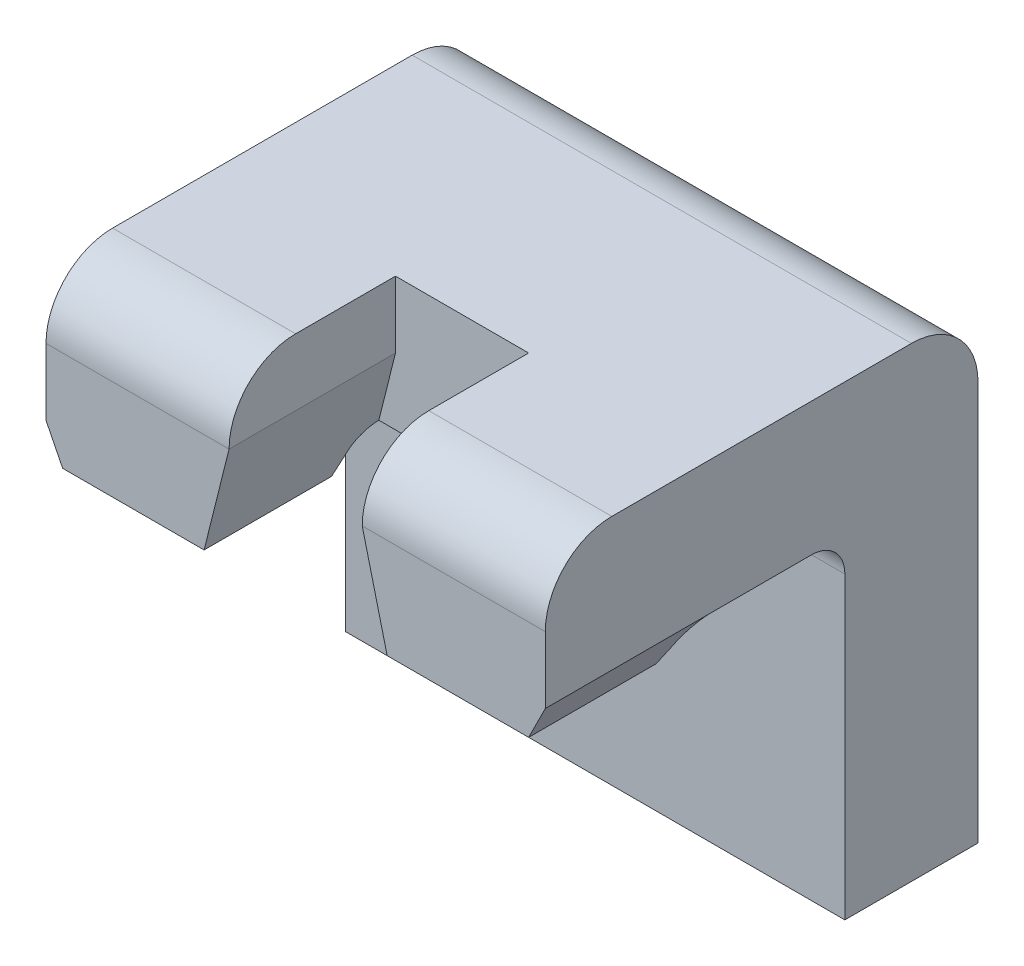
ISO-10303-21;
HEADER;
FILE_DESCRIPTION(('STEP AP214'),'2;1');
FILE_NAME('part.step','',(''),(''),'','','');
FILE_SCHEMA(('AUTOMOTIVE_DESIGN { 1 0 10303 214 1 1 1 1 }'));
ENDSEC;
DATA;
#1=APPLICATION_CONTEXT('core data for automotive mechanical design processes');
#2=APPLICATION_PROTOCOL_DEFINITION('international standard','automotive_design',2000,#1);
#3=PRODUCT_CONTEXT('',#1,'mechanical');
#4=PRODUCT('Part','Part','',(#3));
#5=PRODUCT_RELATED_PRODUCT_CATEGORY('part','',(#4));
#6=PRODUCT_DEFINITION_FORMATION('','',#4);
#7=PRODUCT_DEFINITION_CONTEXT('part definition',#1,'design');
#8=PRODUCT_DEFINITION('design','',#6,#7);
#9=PRODUCT_DEFINITION_SHAPE('','',#8);
#10=(LENGTH_UNIT() NAMED_UNIT(*) SI_UNIT(.MILLI.,.METRE.));
#11=(NAMED_UNIT(*) PLANE_ANGLE_UNIT() SI_UNIT($,.RADIAN.));
#12=(NAMED_UNIT(*) SI_UNIT($,.STERADIAN.) SOLID_ANGLE_UNIT());
#13=UNCERTAINTY_MEASURE_WITH_UNIT(LENGTH_MEASURE(1.E-05),#10,'distance_accuracy_value','');
#14=(GEOMETRIC_REPRESENTATION_CONTEXT(3) GLOBAL_UNCERTAINTY_ASSIGNED_CONTEXT((#13)) GLOBAL_UNIT_ASSIGNED_CONTEXT((#10,
#11,#12)) REPRESENTATION_CONTEXT('',''));
#15=CARTESIAN_POINT('',(0.,0.,0.));
#16=DIRECTION('',(0.,0.,1.));
#17=DIRECTION('',(1.,0.,0.));
#18=AXIS2_PLACEMENT_3D('',#15,#16,#17);
#19=CARTESIAN_POINT('',(-0.415796148106,0.4,0.49));
#20=DIRECTION('',(0.,0.531864359009179,0.846829559956285));
#21=DIRECTION('',(0.,-0.846829559956285,0.531864359009179));
#22=AXIS2_PLACEMENT_3D('',#19,#20,#21);
#23=PLANE('',#22);
#24=DIRECTION('',(-1.,0.,0.));
#25=VECTOR('',#24,1.);
#26=CARTESIAN_POINT('',(-0.875,0.45,0.45859672925));
#27=LINE('',#26,#25);
#28=CARTESIAN_POINT('',(0.35,0.45,0.45859672925));
#29=VERTEX_POINT('',#28);
#30=CARTESIAN_POINT('',(0.137500000000008,0.450000000000002,0.45859672925));
#31=VERTEX_POINT('',#30);
#32=EDGE_CURVE('E301',#29,#31,#27,.T.);
#33=ORIENTED_EDGE('',*,*,#32,.T.);
#34=DIRECTION('',(-0.207116775159689,0.82846710063961,-0.520331533356617));
#35=VECTOR('',#34,1.);
#36=CARTESIAN_POINT('',(0.137500000000012,0.450000000000003,0.45859672925));
#37=LINE('',#36,#35);
#38=CARTESIAN_POINT('',(0.132202135712893,0.471191457148502,0.445287107921827));
#39=VERTEX_POINT('',#38);
#40=EDGE_CURVE('E274',#31,#39,#37,.T.);
#41=ORIENTED_EDGE('',*,*,#40,.T.);
#42=DIRECTION('',(1.,0.,0.));
#43=VECTOR('',#42,1.);
#44=CARTESIAN_POINT('',(-0.375,0.47119145714682,0.445287107922614));
#45=LINE('',#44,#43);
#46=CARTESIAN_POINT('',(0.360595728573993,0.471191457147986,0.445287107922069));
#47=VERTEX_POINT('',#46);
#48=EDGE_CURVE('E178',#39,#47,#45,.T.);
#49=ORIENTED_EDGE('',*,*,#48,.T.);
#50=DIRECTION('',(-0.389903858619995,-0.779807717239989,0.489770257535302));
#51=VECTOR('',#50,1.);
#52=CARTESIAN_POINT('',(0.3605957285734,0.4711914571468,0.445287107923));
#53=LINE('',#52,#51);
#54=EDGE_CURVE('E291',#47,#29,#53,.T.);
#55=ORIENTED_EDGE('',*,*,#54,.T.);
#56=EDGE_LOOP('',(#33,#41,#49,#55));
#57=FACE_BOUND('',#56,.T.);
#58=ADVANCED_FACE('F17',(#57),#23,.F.);
#59=CARTESIAN_POINT('',(-0.875,0.45,0.));
#60=DIRECTION('',(0.,1.,0.));
#61=DIRECTION('',(-1.,0.,0.));
#62=AXIS2_PLACEMENT_3D('',#59,#60,#61);
#63=PLANE('',#62);
#64=DIRECTION('',(0.,0.,1.));
#65=VECTOR('',#64,1.);
#66=CARTESIAN_POINT('',(0.35,0.45,0.4));
#67=LINE('',#66,#65);
#68=CARTESIAN_POINT('',(0.35,0.45,0.65));
#69=VERTEX_POINT('',#68);
#70=EDGE_CURVE('E288',#29,#69,#67,.T.);
#71=ORIENTED_EDGE('',*,*,#70,.T.);
#72=DIRECTION('',(1.,0.,0.));
#73=VECTOR('',#72,1.);
#74=CARTESIAN_POINT('',(-0.375,0.45,0.65));
#75=LINE('',#74,#73);
#76=CARTESIAN_POINT('',(0.137500000000006,0.450000000000001,0.65));
#77=VERTEX_POINT('',#76);
#78=EDGE_CURVE('E290',#77,#69,#75,.T.);
#79=ORIENTED_EDGE('',*,*,#78,.F.);
#80=DIRECTION('',(0.,0.,1.));
#81=VECTOR('',#80,1.);
#82=CARTESIAN_POINT('',(0.137500000000012,0.450000000000003,0.4));
#83=LINE('',#82,#81);
#84=EDGE_CURVE('E279',#77,#31,#83,.F.);
#85=ORIENTED_EDGE('',*,*,#84,.T.);
#86=ORIENTED_EDGE('',*,*,#32,.F.);
#87=EDGE_LOOP('',(#71,#79,#85,#86));
#88=FACE_BOUND('',#87,.T.);
#89=ADVANCED_FACE('F391',(#88),#63,.F.);
#90=CARTESIAN_POINT('',(0.15,0.4,0.4));
#91=DIRECTION('',(0.970142500145391,0.242535625036098,0.));
#92=DIRECTION('',(-0.242535625036098,0.970142500145391,0.));
#93=AXIS2_PLACEMENT_3D('',#90,#91,#92);
#94=PLANE('',#93);
#95=ORIENTED_EDGE('',*,*,#84,.F.);
#96=DIRECTION('',(0.242535625036333,-0.970142500145332,0.));
#97=VECTOR('',#96,1.);
#98=CARTESIAN_POINT('',(0.1,0.6,0.65));
#99=LINE('',#98,#97);
#100=CARTESIAN_POINT('',(0.1,0.6,0.65));
#101=VERTEX_POINT('',#100);
#102=EDGE_CURVE('E282',#101,#77,#99,.T.);
#103=ORIENTED_EDGE('',*,*,#102,.F.);
#104=DIRECTION('',(0.,0.,1.));
#105=VECTOR('',#104,1.);
#106=CARTESIAN_POINT('',(0.1,0.6,0.4));
#107=LINE('',#106,#105);
#108=CARTESIAN_POINT('',(0.1,0.6,0.4));
#109=VERTEX_POINT('',#108);
#110=EDGE_CURVE('E164',#101,#109,#107,.F.);
#111=ORIENTED_EDGE('',*,*,#110,.T.);
#112=DIRECTION('',(0.242535625036333,-0.970142500145332,0.));
#113=VECTOR('',#112,1.);
#114=CARTESIAN_POINT('',(0.1,0.6,0.4));
#115=LINE('',#114,#113);
#116=CARTESIAN_POINT('',(0.125000000000013,0.5,0.4));
#117=VERTEX_POINT('',#116);
#118=EDGE_CURVE('E157',#109,#117,#115,.T.);
#119=ORIENTED_EDGE('',*,*,#118,.T.);
#120=CARTESIAN_POINT('',(0.137500000000013,0.45,0.4));
#121=DIRECTION('',(0.970142500145391,0.242535625036098,0.));
#122=DIRECTION('',(0.242535625036098,-0.970142500145391,0.));
#123=AXIS2_PLACEMENT_3D('',#120,#121,#122);
#124=ELLIPSE('',#123,0.0515388203202176,0.05);
#125=EDGE_CURVE('E20',#117,#39,#124,.T.);
#126=ORIENTED_EDGE('',*,*,#125,.T.);
#127=ORIENTED_EDGE('',*,*,#40,.F.);
#128=EDGE_LOOP('',(#95,#103,#111,#119,#126,#127));
#129=FACE_BOUND('',#128,.T.);
#130=ADVANCED_FACE('F160',(#129),#94,.F.);
#131=CARTESIAN_POINT('',(-0.415796148106,0.4,0.49));
#132=DIRECTION('',(0.,0.531864359009179,0.846829559956285));
#133=DIRECTION('',(0.,-0.846829559956285,0.531864359009179));
#134=AXIS2_PLACEMENT_3D('',#131,#132,#133);
#135=PLANE('',#134);
#136=DIRECTION('',(-1.,0.,0.));
#137=VECTOR('',#136,1.);
#138=CARTESIAN_POINT('',(-0.875,0.45,0.45859672925));
#139=LINE('',#138,#137);
#140=CARTESIAN_POINT('',(-0.137500000000008,0.450000000000002,0.45859672925));
#141=VERTEX_POINT('',#140);
#142=CARTESIAN_POINT('',(-0.35,0.45,0.45859672925));
#143=VERTEX_POINT('',#142);
#144=EDGE_CURVE('E267',#141,#143,#139,.T.);
#145=ORIENTED_EDGE('',*,*,#144,.T.);
#146=DIRECTION('',(-0.389903858619995,0.779807717239989,-0.489770257535302));
#147=VECTOR('',#146,1.);
#148=CARTESIAN_POINT('',(-0.35,0.45,0.45859672925));
#149=LINE('',#148,#147);
#150=CARTESIAN_POINT('',(-0.360595728573993,0.471191457147986,0.445287107922069));
#151=VERTEX_POINT('',#150);
#152=EDGE_CURVE('E257',#143,#151,#149,.T.);
#153=ORIENTED_EDGE('',*,*,#152,.T.);
#154=DIRECTION('',(1.,0.,0.));
#155=VECTOR('',#154,1.);
#156=CARTESIAN_POINT('',(-0.375,0.47119145714682,0.445287107922614));
#157=LINE('',#156,#155);
#158=CARTESIAN_POINT('',(-0.132202135712893,0.471191457148502,0.445287107921827));
#159=VERTEX_POINT('',#158);
#160=EDGE_CURVE('E209',#151,#159,#157,.T.);
#161=ORIENTED_EDGE('',*,*,#160,.T.);
#162=DIRECTION('',(-0.207116775159689,-0.82846710063961,0.520331533356617));
#163=VECTOR('',#162,1.);
#164=CARTESIAN_POINT('',(-0.132202135713253,0.471191457147063,0.445287107923));
#165=LINE('',#164,#163);
#166=EDGE_CURVE('E265',#159,#141,#165,.T.);
#167=ORIENTED_EDGE('',*,*,#166,.T.);
#168=EDGE_LOOP('',(#145,#153,#161,#167));
#169=FACE_BOUND('',#168,.T.);
#170=ADVANCED_FACE('F425',(#169),#135,.F.);
#171=CARTESIAN_POINT('',(-0.875,0.45,0.));
#172=DIRECTION('',(0.,1.,0.));
#173=DIRECTION('',(-1.,0.,0.));
#174=AXIS2_PLACEMENT_3D('',#171,#172,#173);
#175=PLANE('',#174);
#176=DIRECTION('',(0.,0.,1.));
#177=VECTOR('',#176,1.);
#178=CARTESIAN_POINT('',(-0.137500000000012,0.450000000000003,0.4));
#179=LINE('',#178,#177);
#180=CARTESIAN_POINT('',(-0.137500000000004,0.450000000000001,0.65));
#181=VERTEX_POINT('',#180);
#182=EDGE_CURVE('E241',#141,#181,#179,.T.);
#183=ORIENTED_EDGE('',*,*,#182,.T.);
#184=DIRECTION('',(1.,0.,0.));
#185=VECTOR('',#184,1.);
#186=CARTESIAN_POINT('',(-0.375,0.45,0.65));
#187=LINE('',#186,#185);
#188=CARTESIAN_POINT('',(-0.35,0.45,0.65));
#189=VERTEX_POINT('',#188);
#190=EDGE_CURVE('E251',#189,#181,#187,.T.);
#191=ORIENTED_EDGE('',*,*,#190,.F.);
#192=DIRECTION('',(0.,0.,1.));
#193=VECTOR('',#192,1.);
#194=CARTESIAN_POINT('',(-0.35,0.45,0.4));
#195=LINE('',#194,#193);
#196=EDGE_CURVE('E254',#189,#143,#195,.F.);
#197=ORIENTED_EDGE('',*,*,#196,.T.);
#198=ORIENTED_EDGE('',*,*,#144,.F.);
#199=EDGE_LOOP('',(#183,#191,#197,#198));
#200=FACE_BOUND('',#199,.T.);
#201=ADVANCED_FACE('F419',(#200),#175,.F.);
#202=CARTESIAN_POINT('',(-0.15,0.4,0.4));
#203=DIRECTION('',(-0.970142500145391,0.242535625036098,0.));
#204=DIRECTION('',(-0.242535625036098,-0.970142500145391,0.));
#205=AXIS2_PLACEMENT_3D('',#202,#203,#204);
#206=PLANE('',#205);
#207=ORIENTED_EDGE('',*,*,#182,.F.);
#208=ORIENTED_EDGE('',*,*,#166,.F.);
#209=CARTESIAN_POINT('',(-0.137500000000013,0.45,0.4));
#210=DIRECTION('',(-0.970142500145391,0.242535625036098,0.));
#211=DIRECTION('',(0.242535625036098,0.970142500145391,0.));
#212=AXIS2_PLACEMENT_3D('',#209,#210,#211);
#213=ELLIPSE('',#212,0.0515388203202176,0.05);
#214=CARTESIAN_POINT('',(-0.125000000000013,0.5,0.4));
#215=VERTEX_POINT('',#214);
#216=EDGE_CURVE('E210',#159,#215,#213,.T.);
#217=ORIENTED_EDGE('',*,*,#216,.T.);
#218=DIRECTION('',(0.242535625036333,0.970142500145332,0.));
#219=VECTOR('',#218,1.);
#220=CARTESIAN_POINT('',(-0.125,0.5,0.4));
#221=LINE('',#220,#219);
#222=CARTESIAN_POINT('',(-0.1,0.6,0.4));
#223=VERTEX_POINT('',#222);
#224=EDGE_CURVE('E169',#215,#223,#221,.T.);
#225=ORIENTED_EDGE('',*,*,#224,.T.);
#226=DIRECTION('',(0.,0.,1.));
#227=VECTOR('',#226,1.);
#228=CARTESIAN_POINT('',(-0.1,0.6,0.4));
#229=LINE('',#228,#227);
#230=CARTESIAN_POINT('',(-0.1,0.6,0.65));
#231=VERTEX_POINT('',#230);
#232=EDGE_CURVE('E218',#223,#231,#229,.T.);
#233=ORIENTED_EDGE('',*,*,#232,.T.);
#234=DIRECTION('',(0.242535625036333,0.970142500145332,0.));
#235=VECTOR('',#234,1.);
#236=CARTESIAN_POINT('',(-0.1375,0.45,0.65));
#237=LINE('',#236,#235);
#238=EDGE_CURVE('E247',#181,#231,#237,.T.);
#239=ORIENTED_EDGE('',*,*,#238,.F.);
#240=EDGE_LOOP('',(#207,#208,#217,#225,#233,#239));
#241=FACE_BOUND('',#240,.T.);
#242=ADVANCED_FACE('F340',(#241),#206,.F.);
#243=CARTESIAN_POINT('',(0.1,0.4,0.4));
#244=DIRECTION('',(1.,0.,0.));
#245=DIRECTION('',(0.,1.,0.));
#246=AXIS2_PLACEMENT_3D('',#243,#244,#245);
#247=PLANE('',#246);
#248=ORIENTED_EDGE('',*,*,#110,.F.);
#249=CARTESIAN_POINT('',(0.1,0.6,0.55));
#250=DIRECTION('',(1.,0.,0.));
#251=DIRECTION('',(0.,0.,-1.));
#252=AXIS2_PLACEMENT_3D('',#249,#250,#251);
#253=CIRCLE('',#252,0.1);
#254=CARTESIAN_POINT('',(0.1,0.7,0.55));
#255=VERTEX_POINT('',#254);
#256=EDGE_CURVE('E334',#255,#101,#253,.T.);
#257=ORIENTED_EDGE('',*,*,#256,.F.);
#258=DIRECTION('',(0.,0.,1.));
#259=VECTOR('',#258,1.);
#260=CARTESIAN_POINT('',(0.1,0.7,0.55));
#261=LINE('',#260,#259);
#262=CARTESIAN_POINT('',(0.1,0.7,0.4));
#263=VERTEX_POINT('',#262);
#264=EDGE_CURVE('E208',#263,#255,#261,.T.);
#265=ORIENTED_EDGE('',*,*,#264,.F.);
#266=DIRECTION('',(0.,1.,0.));
#267=VECTOR('',#266,1.);
#268=CARTESIAN_POINT('',(0.1,0.7,0.4));
#269=LINE('',#268,#267);
#270=EDGE_CURVE('E170',#263,#109,#269,.F.);
#271=ORIENTED_EDGE('',*,*,#270,.T.);
#272=EDGE_LOOP('',(#248,#257,#265,#271));
#273=FACE_BOUND('',#272,.T.);
#274=ADVANCED_FACE('F404',(#273),#247,.F.);
#275=CARTESIAN_POINT('',(-0.1,0.4,0.4));
#276=DIRECTION('',(-1.,0.,0.));
#277=DIRECTION('',(0.,-1.,0.));
#278=AXIS2_PLACEMENT_3D('',#275,#276,#277);
#279=PLANE('',#278);
#280=ORIENTED_EDGE('',*,*,#232,.F.);
#281=DIRECTION('',(0.,1.,0.));
#282=VECTOR('',#281,1.);
#283=CARTESIAN_POINT('',(-0.1,0.7,0.4));
#284=LINE('',#283,#282);
#285=CARTESIAN_POINT('',(-0.1,0.7,0.4));
#286=VERTEX_POINT('',#285);
#287=EDGE_CURVE('E179',#223,#286,#284,.T.);
#288=ORIENTED_EDGE('',*,*,#287,.T.);
#289=DIRECTION('',(0.,0.,1.));
#290=VECTOR('',#289,1.);
#291=CARTESIAN_POINT('',(-0.1,0.7,0.55));
#292=LINE('',#291,#290);
#293=CARTESIAN_POINT('',(-0.1,0.7,0.55));
#294=VERTEX_POINT('',#293);
#295=EDGE_CURVE('E222',#294,#286,#292,.F.);
#296=ORIENTED_EDGE('',*,*,#295,.F.);
#297=CARTESIAN_POINT('',(-0.1,0.6,0.55));
#298=DIRECTION('',(1.,0.,0.));
#299=DIRECTION('',(0.,0.,-1.));
#300=AXIS2_PLACEMENT_3D('',#297,#298,#299);
#301=CIRCLE('',#300,0.1);
#302=EDGE_CURVE('E329',#231,#294,#301,.F.);
#303=ORIENTED_EDGE('',*,*,#302,.F.);
#304=EDGE_LOOP('',(#280,#288,#296,#303));
#305=FACE_BOUND('',#304,.T.);
#306=ADVANCED_FACE('F412',(#305),#279,.F.);
#307=CARTESIAN_POINT('',(-0.375,0.45,0.4));
#308=DIRECTION('',(1.,0.,0.));
#309=DIRECTION('',(0.,0.,-1.));
#310=AXIS2_PLACEMENT_3D('',#307,#308,#309);
#311=CYLINDRICAL_SURFACE('',#310,0.05);
#312=DIRECTION('',(1.,0.,0.));
#313=VECTOR('',#312,1.);
#314=CARTESIAN_POINT('',(-0.375,0.5,0.4));
#315=LINE('',#314,#313);
#316=CARTESIAN_POINT('',(0.375,0.5,0.4));
#317=VERTEX_POINT('',#316);
#318=EDGE_CURVE('E176',#317,#117,#315,.F.);
#319=ORIENTED_EDGE('',*,*,#318,.F.);
#320=CARTESIAN_POINT('',(0.35,0.45,0.4));
#321=DIRECTION('',(-0.894427190999916,0.447213595499958,0.));
#322=DIRECTION('',(0.447213595499958,0.894427190999916,0.));
#323=AXIS2_PLACEMENT_3D('',#320,#321,#322);
#324=ELLIPSE('',#323,0.0559016994374947,0.05);
#325=EDGE_CURVE('E332',#317,#47,#324,.F.);
#326=ORIENTED_EDGE('',*,*,#325,.T.);
#327=ORIENTED_EDGE('',*,*,#48,.F.);
#328=ORIENTED_EDGE('',*,*,#125,.F.);
#329=EDGE_LOOP('',(#319,#326,#327,#328));
#330=FACE_BOUND('',#329,.T.);
#331=ADVANCED_FACE('F173',(#330),#311,.F.);
#332=CARTESIAN_POINT('',(0.1,0.7,0.4));
#333=DIRECTION('',(0.,0.,-1.));
#334=DIRECTION('',(-1.,0.,0.));
#335=AXIS2_PLACEMENT_3D('',#332,#333,#334);
#336=PLANE('',#335);
#337=DIRECTION('',(1.,0.,0.));
#338=VECTOR('',#337,1.);
#339=CARTESIAN_POINT('',(-0.375,0.5,0.4));
#340=LINE('',#339,#338);
#341=EDGE_CURVE('E182',#117,#215,#340,.F.);
#342=ORIENTED_EDGE('',*,*,#341,.F.);
#343=ORIENTED_EDGE('',*,*,#118,.F.);
#344=ORIENTED_EDGE('',*,*,#270,.F.);
#345=DIRECTION('',(1.,0.,0.));
#346=VECTOR('',#345,1.);
#347=CARTESIAN_POINT('',(-0.375,0.7,0.4));
#348=LINE('',#347,#346);
#349=EDGE_CURVE('E225',#286,#263,#348,.T.);
#350=ORIENTED_EDGE('',*,*,#349,.F.);
#351=ORIENTED_EDGE('',*,*,#287,.F.);
#352=ORIENTED_EDGE('',*,*,#224,.F.);
#353=EDGE_LOOP('',(#342,#343,#344,#350,#351,#352));
#354=FACE_BOUND('',#353,.T.);
#355=ADVANCED_FACE('F183',(#354),#336,.F.);
#356=CARTESIAN_POINT('',(-0.375,0.45,0.4));
#357=DIRECTION('',(1.,0.,0.));
#358=DIRECTION('',(0.,0.,-1.));
#359=AXIS2_PLACEMENT_3D('',#356,#357,#358);
#360=CYLINDRICAL_SURFACE('',#359,0.05);
#361=DIRECTION('',(1.,0.,0.));
#362=VECTOR('',#361,1.);
#363=CARTESIAN_POINT('',(-0.375,0.5,0.4));
#364=LINE('',#363,#362);
#365=CARTESIAN_POINT('',(-0.375,0.5,0.4));
#366=VERTEX_POINT('',#365);
#367=EDGE_CURVE('E189',#215,#366,#364,.F.);
#368=ORIENTED_EDGE('',*,*,#367,.F.);
#369=ORIENTED_EDGE('',*,*,#216,.F.);
#370=ORIENTED_EDGE('',*,*,#160,.F.);
#371=CARTESIAN_POINT('',(-0.35,0.45,0.4));
#372=DIRECTION('',(0.894427190999916,0.447213595499958,0.));
#373=DIRECTION('',(0.447213595499958,-0.894427190999916,0.));
#374=AXIS2_PLACEMENT_3D('',#371,#372,#373);
#375=ELLIPSE('',#374,0.0559016994374947,0.05);
#376=EDGE_CURVE('E258',#151,#366,#375,.F.);
#377=ORIENTED_EDGE('',*,*,#376,.T.);
#378=EDGE_LOOP('',(#368,#369,#370,#377));
#379=FACE_BOUND('',#378,.T.);
#380=ADVANCED_FACE('F342',(#379),#360,.F.);
#381=CARTESIAN_POINT('',(-0.375,0.6,0.55));
#382=DIRECTION('',(1.,0.,0.));
#383=DIRECTION('',(0.,0.,-1.));
#384=AXIS2_PLACEMENT_3D('',#381,#382,#383);
#385=CYLINDRICAL_SURFACE('',#384,0.1);
#386=CARTESIAN_POINT('',(0.375,0.6,0.55));
#387=DIRECTION('',(1.,0.,0.));
#388=DIRECTION('',(0.,0.,-1.));
#389=AXIS2_PLACEMENT_3D('',#386,#387,#388);
#390=CIRCLE('',#389,0.1);
#391=CARTESIAN_POINT('',(0.375,0.6,0.65));
#392=VERTEX_POINT('',#391);
#393=CARTESIAN_POINT('',(0.375,0.7,0.55));
#394=VERTEX_POINT('',#393);
#395=EDGE_CURVE('E326',#392,#394,#390,.F.);
#396=ORIENTED_EDGE('',*,*,#395,.T.);
#397=DIRECTION('',(1.,0.,0.));
#398=VECTOR('',#397,1.);
#399=CARTESIAN_POINT('',(-0.375,0.7,0.55));
#400=LINE('',#399,#398);
#401=EDGE_CURVE('E204',#255,#394,#400,.T.);
#402=ORIENTED_EDGE('',*,*,#401,.F.);
#403=ORIENTED_EDGE('',*,*,#256,.T.);
#404=DIRECTION('',(1.,0.,0.));
#405=VECTOR('',#404,1.);
#406=CARTESIAN_POINT('',(-0.375,0.6,0.65));
#407=LINE('',#406,#405);
#408=EDGE_CURVE('E285',#392,#101,#407,.F.);
#409=ORIENTED_EDGE('',*,*,#408,.F.);
#410=EDGE_LOOP('',(#396,#402,#403,#409));
#411=FACE_BOUND('',#410,.T.);
#412=ADVANCED_FACE('F401',(#411),#385,.T.);
#413=CARTESIAN_POINT('',(0.375,0.5,0.4));
#414=DIRECTION('',(-0.894427190999916,0.447213595499958,0.));
#415=DIRECTION('',(-0.447213595499958,-0.894427190999916,0.));
#416=AXIS2_PLACEMENT_3D('',#413,#414,#415);
#417=PLANE('',#416);
#418=ORIENTED_EDGE('',*,*,#70,.F.);
#419=ORIENTED_EDGE('',*,*,#54,.F.);
#420=ORIENTED_EDGE('',*,*,#325,.F.);
#421=DIRECTION('',(0.,0.,1.));
#422=VECTOR('',#421,1.);
#423=CARTESIAN_POINT('',(0.375,0.5,0.25));
#424=LINE('',#423,#422);
#425=CARTESIAN_POINT('',(0.375,0.5,0.65));
#426=VERTEX_POINT('',#425);
#427=EDGE_CURVE('E381',#317,#426,#424,.T.);
#428=ORIENTED_EDGE('',*,*,#427,.T.);
#429=DIRECTION('',(0.447213595499959,0.894427190999915,0.));
#430=VECTOR('',#429,1.);
#431=CARTESIAN_POINT('',(0.35,0.45,0.65));
#432=LINE('',#431,#430);
#433=EDGE_CURVE('E296',#69,#426,#432,.T.);
#434=ORIENTED_EDGE('',*,*,#433,.F.);
#435=EDGE_LOOP('',(#418,#419,#420,#428,#434));
#436=FACE_BOUND('',#435,.T.);
#437=ADVANCED_FACE('F393',(#436),#417,.F.);
#438=CARTESIAN_POINT('',(-0.375,0.4,0.65));
#439=DIRECTION('',(0.,0.,1.));
#440=DIRECTION('',(1.,0.,0.));
#441=AXIS2_PLACEMENT_3D('',#438,#439,#440);
#442=PLANE('',#441);
#443=ORIENTED_EDGE('',*,*,#408,.T.);
#444=ORIENTED_EDGE('',*,*,#102,.T.);
#445=ORIENTED_EDGE('',*,*,#78,.T.);
#446=ORIENTED_EDGE('',*,*,#433,.T.);
#447=DIRECTION('',(0.,1.,0.));
#448=VECTOR('',#447,1.);
#449=CARTESIAN_POINT('',(0.375,0.45,0.65));
#450=LINE('',#449,#448);
#451=EDGE_CURVE('E383',#426,#392,#450,.T.);
#452=ORIENTED_EDGE('',*,*,#451,.T.);
#453=EDGE_LOOP('',(#443,#444,#445,#446,#452));
#454=FACE_BOUND('',#453,.T.);
#455=ADVANCED_FACE('F398',(#454),#442,.T.);
#456=CARTESIAN_POINT('',(-0.375,0.5,0.4));
#457=DIRECTION('',(0.894427190999916,0.447213595499958,0.));
#458=DIRECTION('',(-0.447213595499958,0.894427190999916,0.));
#459=AXIS2_PLACEMENT_3D('',#456,#457,#458);
#460=PLANE('',#459);
#461=ORIENTED_EDGE('',*,*,#196,.F.);
#462=DIRECTION('',(0.447213595499958,-0.894427190999916,0.));
#463=VECTOR('',#462,1.);
#464=CARTESIAN_POINT('',(-0.375,0.5,0.65));
#465=LINE('',#464,#463);
#466=CARTESIAN_POINT('',(-0.375,0.5,0.65));
#467=VERTEX_POINT('',#466);
#468=EDGE_CURVE('E250',#467,#189,#465,.T.);
#469=ORIENTED_EDGE('',*,*,#468,.F.);
#470=DIRECTION('',(0.,0.,1.));
#471=VECTOR('',#470,1.);
#472=CARTESIAN_POINT('',(-0.375,0.5,0.25));
#473=LINE('',#472,#471);
#474=EDGE_CURVE('E353',#366,#467,#473,.T.);
#475=ORIENTED_EDGE('',*,*,#474,.F.);
#476=ORIENTED_EDGE('',*,*,#376,.F.);
#477=ORIENTED_EDGE('',*,*,#152,.F.);
#478=EDGE_LOOP('',(#461,#469,#475,#476,#477));
#479=FACE_BOUND('',#478,.T.);
#480=ADVANCED_FACE('F423',(#479),#460,.F.);
#481=CARTESIAN_POINT('',(-0.375,0.4,0.65));
#482=DIRECTION('',(0.,0.,1.));
#483=DIRECTION('',(1.,0.,0.));
#484=AXIS2_PLACEMENT_3D('',#481,#482,#483);
#485=PLANE('',#484);
#486=DIRECTION('',(0.,1.,0.));
#487=VECTOR('',#486,1.);
#488=CARTESIAN_POINT('',(-0.375,0.45,0.65));
#489=LINE('',#488,#487);
#490=CARTESIAN_POINT('',(-0.375,0.6,0.65));
#491=VERTEX_POINT('',#490);
#492=EDGE_CURVE('E319',#467,#491,#489,.T.);
#493=ORIENTED_EDGE('',*,*,#492,.F.);
#494=ORIENTED_EDGE('',*,*,#468,.T.);
#495=ORIENTED_EDGE('',*,*,#190,.T.);
#496=ORIENTED_EDGE('',*,*,#238,.T.);
#497=DIRECTION('',(1.,0.,0.));
#498=VECTOR('',#497,1.);
#499=CARTESIAN_POINT('',(-0.375,0.6,0.65));
#500=LINE('',#499,#498);
#501=EDGE_CURVE('E237',#491,#231,#500,.T.);
#502=ORIENTED_EDGE('',*,*,#501,.F.);
#503=EDGE_LOOP('',(#493,#494,#495,#496,#502));
#504=FACE_BOUND('',#503,.T.);
#505=ADVANCED_FACE('F416',(#504),#485,.T.);
#506=CARTESIAN_POINT('',(-0.375,0.6,0.55));
#507=DIRECTION('',(1.,0.,0.));
#508=DIRECTION('',(0.,0.,-1.));
#509=AXIS2_PLACEMENT_3D('',#506,#507,#508);
#510=CYLINDRICAL_SURFACE('',#509,0.1);
#511=CARTESIAN_POINT('',(-0.375,0.6,0.55));
#512=DIRECTION('',(1.,0.,0.));
#513=DIRECTION('',(0.,0.,-1.));
#514=AXIS2_PLACEMENT_3D('',#511,#512,#513);
#515=CIRCLE('',#514,0.1);
#516=CARTESIAN_POINT('',(-0.375,0.7,0.55));
#517=VERTEX_POINT('',#516);
#518=EDGE_CURVE('E316',#491,#517,#515,.F.);
#519=ORIENTED_EDGE('',*,*,#518,.F.);
#520=ORIENTED_EDGE('',*,*,#501,.T.);
#521=ORIENTED_EDGE('',*,*,#302,.T.);
#522=DIRECTION('',(1.,0.,0.));
#523=VECTOR('',#522,1.);
#524=CARTESIAN_POINT('',(-0.375,0.7,0.55));
#525=LINE('',#524,#523);
#526=EDGE_CURVE('E207',#517,#294,#525,.T.);
#527=ORIENTED_EDGE('',*,*,#526,.F.);
#528=EDGE_LOOP('',(#519,#520,#521,#527));
#529=FACE_BOUND('',#528,.T.);
#530=ADVANCED_FACE('F470',(#529),#510,.T.);
#531=CARTESIAN_POINT('',(-0.375,0.7,0.55));
#532=DIRECTION('',(0.,1.,0.));
#533=DIRECTION('',(0.,0.,1.));
#534=AXIS2_PLACEMENT_3D('',#531,#532,#533);
#535=PLANE('',#534);
#536=ORIENTED_EDGE('',*,*,#295,.T.);
#537=ORIENTED_EDGE('',*,*,#349,.T.);
#538=ORIENTED_EDGE('',*,*,#264,.T.);
#539=ORIENTED_EDGE('',*,*,#401,.T.);
#540=DIRECTION('',(0.,0.,1.));
#541=VECTOR('',#540,1.);
#542=CARTESIAN_POINT('',(0.375,0.7,0.25));
#543=LINE('',#542,#541);
#544=CARTESIAN_POINT('',(0.375,0.7,0.1));
#545=VERTEX_POINT('',#544);
#546=EDGE_CURVE('E325',#394,#545,#543,.F.);
#547=ORIENTED_EDGE('',*,*,#546,.T.);
#548=DIRECTION('',(1.,0.,0.));
#549=VECTOR('',#548,1.);
#550=CARTESIAN_POINT('',(-0.375,0.7,0.1));
#551=LINE('',#550,#549);
#552=CARTESIAN_POINT('',(-0.375,0.7,0.1));
#553=VERTEX_POINT('',#552);
#554=EDGE_CURVE('E328',#553,#545,#551,.T.);
#555=ORIENTED_EDGE('',*,*,#554,.F.);
#556=DIRECTION('',(0.,0.,1.));
#557=VECTOR('',#556,1.);
#558=CARTESIAN_POINT('',(-0.375,0.7,0.25));
#559=LINE('',#558,#557);
#560=EDGE_CURVE('E315',#517,#553,#559,.F.);
#561=ORIENTED_EDGE('',*,*,#560,.F.);
#562=ORIENTED_EDGE('',*,*,#526,.T.);
#563=EDGE_LOOP('',(#536,#537,#538,#539,#547,#555,#561,#562));
#564=FACE_BOUND('',#563,.T.);
#565=ADVANCED_FACE('F407',(#564),#535,.T.);
#566=CARTESIAN_POINT('',(-0.375,0.,0.2));
#567=DIRECTION('',(0.,0.,1.));
#568=DIRECTION('',(1.,0.,0.));
#569=AXIS2_PLACEMENT_3D('',#566,#567,#568);
#570=PLANE('',#569);
#571=DIRECTION('',(1.,0.,0.));
#572=VECTOR('',#571,1.);
#573=CARTESIAN_POINT('',(-0.375,0.45,0.2));
#574=LINE('',#573,#572);
#575=CARTESIAN_POINT('',(0.375,0.45,0.2));
#576=VERTEX_POINT('',#575);
#577=CARTESIAN_POINT('',(-0.375,0.45,0.2));
#578=VERTEX_POINT('',#577);
#579=EDGE_CURVE('E198',#576,#578,#574,.F.);
#580=ORIENTED_EDGE('',*,*,#579,.T.);
#581=DIRECTION('',(0.,1.,0.));
#582=VECTOR('',#581,1.);
#583=CARTESIAN_POINT('',(-0.375,0.45,0.2));
#584=LINE('',#583,#582);
#585=CARTESIAN_POINT('',(-0.375,0.,0.2));
#586=VERTEX_POINT('',#585);
#587=EDGE_CURVE('E311',#586,#578,#584,.T.);
#588=ORIENTED_EDGE('',*,*,#587,.F.);
#589=DIRECTION('',(1.,0.,0.));
#590=VECTOR('',#589,1.);
#591=CARTESIAN_POINT('',(-0.375,0.,0.2));
#592=LINE('',#591,#590);
#593=CARTESIAN_POINT('',(0.375,0.,0.2));
#594=VERTEX_POINT('',#593);
#595=EDGE_CURVE('E356',#594,#586,#592,.F.);
#596=ORIENTED_EDGE('',*,*,#595,.F.);
#597=DIRECTION('',(0.,1.,0.));
#598=VECTOR('',#597,1.);
#599=CARTESIAN_POINT('',(0.375,0.45,0.2));
#600=LINE('',#599,#598);
#601=EDGE_CURVE('E322',#594,#576,#600,.T.);
#602=ORIENTED_EDGE('',*,*,#601,.T.);
#603=EDGE_LOOP('',(#580,#588,#596,#602));
#604=FACE_BOUND('',#603,.T.);
#605=ADVANCED_FACE('F463',(#604),#570,.T.);
#606=CARTESIAN_POINT('',(-0.375,0.45,0.25));
#607=DIRECTION('',(1.,0.,0.));
#608=DIRECTION('',(0.,0.,-1.));
#609=AXIS2_PLACEMENT_3D('',#606,#607,#608);
#610=CYLINDRICAL_SURFACE('',#609,0.05);
#611=DIRECTION('',(1.,0.,0.));
#612=VECTOR('',#611,1.);
#613=CARTESIAN_POINT('',(-0.375,0.5,0.25));
#614=LINE('',#613,#612);
#615=CARTESIAN_POINT('',(-0.375,0.5,0.25));
#616=VERTEX_POINT('',#615);
#617=CARTESIAN_POINT('',(0.375,0.5,0.25));
#618=VERTEX_POINT('',#617);
#619=EDGE_CURVE('E196',#616,#618,#614,.T.);
#620=ORIENTED_EDGE('',*,*,#619,.F.);
#621=CARTESIAN_POINT('',(-0.375,0.45,0.25));
#622=DIRECTION('',(1.,0.,0.));
#623=DIRECTION('',(0.,0.,-1.));
#624=AXIS2_PLACEMENT_3D('',#621,#622,#623);
#625=CIRCLE('',#624,0.05);
#626=EDGE_CURVE('E307',#578,#616,#625,.T.);
#627=ORIENTED_EDGE('',*,*,#626,.F.);
#628=ORIENTED_EDGE('',*,*,#579,.F.);
#629=CARTESIAN_POINT('',(0.375,0.45,0.25));
#630=DIRECTION('',(1.,0.,0.));
#631=DIRECTION('',(0.,0.,-1.));
#632=AXIS2_PLACEMENT_3D('',#629,#630,#631);
#633=CIRCLE('',#632,0.05);
#634=EDGE_CURVE('E320',#576,#618,#633,.T.);
#635=ORIENTED_EDGE('',*,*,#634,.T.);
#636=EDGE_LOOP('',(#620,#627,#628,#635));
#637=FACE_BOUND('',#636,.T.);
#638=ADVANCED_FACE('F460',(#637),#610,.F.);
#639=CARTESIAN_POINT('',(-0.375,0.5,0.25));
#640=DIRECTION('',(0.,-1.,0.));
#641=DIRECTION('',(0.,0.,-1.));
#642=AXIS2_PLACEMENT_3D('',#639,#640,#641);
#643=PLANE('',#642);
#644=ORIENTED_EDGE('',*,*,#367,.T.);
#645=DIRECTION('',(0.,0.,1.));
#646=VECTOR('',#645,1.);
#647=CARTESIAN_POINT('',(-0.375,0.5,0.25));
#648=LINE('',#647,#646);
#649=EDGE_CURVE('E310',#616,#366,#648,.T.);
#650=ORIENTED_EDGE('',*,*,#649,.F.);
#651=ORIENTED_EDGE('',*,*,#619,.T.);
#652=DIRECTION('',(0.,0.,1.));
#653=VECTOR('',#652,1.);
#654=CARTESIAN_POINT('',(0.375,0.5,0.25));
#655=LINE('',#654,#653);
#656=EDGE_CURVE('E194',#618,#317,#655,.T.);
#657=ORIENTED_EDGE('',*,*,#656,.T.);
#658=ORIENTED_EDGE('',*,*,#318,.T.);
#659=ORIENTED_EDGE('',*,*,#341,.T.);
#660=EDGE_LOOP('',(#644,#650,#651,#657,#658,#659));
#661=FACE_BOUND('',#660,.T.);
#662=ADVANCED_FACE('F191',(#661),#643,.T.);
#663=CARTESIAN_POINT('',(-0.375,0.6,0.1));
#664=DIRECTION('',(1.,0.,0.));
#665=DIRECTION('',(0.,0.,-1.));
#666=AXIS2_PLACEMENT_3D('',#663,#664,#665);
#667=CYLINDRICAL_SURFACE('',#666,0.1);
#668=DIRECTION('',(-1.,0.,0.));
#669=VECTOR('',#668,1.);
#670=CARTESIAN_POINT('',(-0.375,0.6,0.));
#671=LINE('',#670,#669);
#672=CARTESIAN_POINT('',(-0.375,0.6,0.));
#673=VERTEX_POINT('',#672);
#674=CARTESIAN_POINT('',(0.375,0.6,0.));
#675=VERTEX_POINT('',#674);
#676=EDGE_CURVE('E665',#673,#675,#671,.F.);
#677=ORIENTED_EDGE('',*,*,#676,.F.);
#678=CARTESIAN_POINT('',(-0.375,0.6,0.1));
#679=DIRECTION('',(1.,0.,0.));
#680=DIRECTION('',(0.,0.,-1.));
#681=AXIS2_PLACEMENT_3D('',#678,#679,#680);
#682=CIRCLE('',#681,0.1);
#683=EDGE_CURVE('E312',#553,#673,#682,.F.);
#684=ORIENTED_EDGE('',*,*,#683,.F.);
#685=ORIENTED_EDGE('',*,*,#554,.T.);
#686=CARTESIAN_POINT('',(0.375,0.6,0.1));
#687=DIRECTION('',(1.,0.,0.));
#688=DIRECTION('',(0.,0.,-1.));
#689=AXIS2_PLACEMENT_3D('',#686,#687,#688);
#690=CIRCLE('',#689,0.1);
#691=EDGE_CURVE('E323',#545,#675,#690,.F.);
#692=ORIENTED_EDGE('',*,*,#691,.T.);
#693=EDGE_LOOP('',(#677,#684,#685,#692));
#694=FACE_BOUND('',#693,.T.);
#695=ADVANCED_FACE('F453',(#694),#667,.T.);
#696=CARTESIAN_POINT('',(0.375,0.45,0.25));
#697=DIRECTION('',(-1.,0.,0.));
#698=DIRECTION('',(0.,0.,1.));
#699=AXIS2_PLACEMENT_3D('',#696,#697,#698);
#700=PLANE('',#699);
#701=ORIENTED_EDGE('',*,*,#427,.F.);
#702=ORIENTED_EDGE('',*,*,#656,.F.);
#703=ORIENTED_EDGE('',*,*,#634,.F.);
#704=ORIENTED_EDGE('',*,*,#601,.F.);
#705=DIRECTION('',(0.,0.,-1.));
#706=VECTOR('',#705,1.);
#707=CARTESIAN_POINT('',(0.375,0.,0.));
#708=LINE('',#707,#706);
#709=CARTESIAN_POINT('',(0.375,0.,0.));
#710=VERTEX_POINT('',#709);
#711=EDGE_CURVE('E361',#710,#594,#708,.F.);
#712=ORIENTED_EDGE('',*,*,#711,.F.);
#713=DIRECTION('',(0.,1.,0.));
#714=VECTOR('',#713,1.);
#715=CARTESIAN_POINT('',(0.375,0.6,0.));
#716=LINE('',#715,#714);
#717=EDGE_CURVE('E667',#675,#710,#716,.F.);
#718=ORIENTED_EDGE('',*,*,#717,.F.);
#719=ORIENTED_EDGE('',*,*,#691,.F.);
#720=ORIENTED_EDGE('',*,*,#546,.F.);
#721=ORIENTED_EDGE('',*,*,#395,.F.);
#722=ORIENTED_EDGE('',*,*,#451,.F.);
#723=EDGE_LOOP('',(#701,#702,#703,#704,#712,#718,#719,#720,#721,#722));
#724=FACE_BOUND('',#723,.T.);
#725=ADVANCED_FACE('F450',(#724),#700,.F.);
#726=CARTESIAN_POINT('',(-0.375,0.,0.));
#727=DIRECTION('',(0.,-1.,0.));
#728=DIRECTION('',(0.,0.,-1.));
#729=AXIS2_PLACEMENT_3D('',#726,#727,#728);
#730=PLANE('',#729);
#731=ORIENTED_EDGE('',*,*,#595,.T.);
#732=DIRECTION('',(0.,0.,1.));
#733=VECTOR('',#732,1.);
#734=CARTESIAN_POINT('',(-0.375,0.,0.25));
#735=LINE('',#734,#733);
#736=CARTESIAN_POINT('',(-0.375,0.,0.));
#737=VERTEX_POINT('',#736);
#738=EDGE_CURVE('E35',#737,#586,#735,.T.);
#739=ORIENTED_EDGE('',*,*,#738,.F.);
#740=DIRECTION('',(-1.,0.,0.));
#741=VECTOR('',#740,1.);
#742=CARTESIAN_POINT('',(-0.375,0.,0.));
#743=LINE('',#742,#741);
#744=EDGE_CURVE('E26',#710,#737,#743,.T.);
#745=ORIENTED_EDGE('',*,*,#744,.F.);
#746=ORIENTED_EDGE('',*,*,#711,.T.);
#747=EDGE_LOOP('',(#731,#739,#745,#746));
#748=FACE_BOUND('',#747,.T.);
#749=ADVANCED_FACE('F443',(#748),#730,.T.);
#750=CARTESIAN_POINT('',(-0.375,0.45,0.25));
#751=DIRECTION('',(-1.,0.,0.));
#752=DIRECTION('',(0.,0.,1.));
#753=AXIS2_PLACEMENT_3D('',#750,#751,#752);
#754=PLANE('',#753);
#755=ORIENTED_EDGE('',*,*,#626,.T.);
#756=ORIENTED_EDGE('',*,*,#649,.T.);
#757=ORIENTED_EDGE('',*,*,#474,.T.);
#758=ORIENTED_EDGE('',*,*,#492,.T.);
#759=ORIENTED_EDGE('',*,*,#518,.T.);
#760=ORIENTED_EDGE('',*,*,#560,.T.);
#761=ORIENTED_EDGE('',*,*,#683,.T.);
#762=DIRECTION('',(0.,1.,0.));
#763=VECTOR('',#762,1.);
#764=CARTESIAN_POINT('',(-0.375,0.6,0.));
#765=LINE('',#764,#763);
#766=EDGE_CURVE('E11',#737,#673,#765,.T.);
#767=ORIENTED_EDGE('',*,*,#766,.F.);
#768=ORIENTED_EDGE('',*,*,#738,.T.);
#769=ORIENTED_EDGE('',*,*,#587,.T.);
#770=EDGE_LOOP('',(#755,#756,#757,#758,#759,#760,#761,#767,#768,#769));
#771=FACE_BOUND('',#770,.T.);
#772=ADVANCED_FACE('F437',(#771),#754,.T.);
#773=CARTESIAN_POINT('',(-0.375,0.6,0.));
#774=DIRECTION('',(0.,0.,-1.));
#775=DIRECTION('',(-1.,0.,0.));
#776=AXIS2_PLACEMENT_3D('',#773,#774,#775);
#777=PLANE('',#776);
#778=ORIENTED_EDGE('',*,*,#744,.T.);
#779=ORIENTED_EDGE('',*,*,#766,.T.);
#780=ORIENTED_EDGE('',*,*,#676,.T.);
#781=ORIENTED_EDGE('',*,*,#717,.T.);
#782=EDGE_LOOP('',(#778,#779,#780,#781));
#783=FACE_BOUND('',#782,.T.);
#784=ADVANCED_FACE('F435',(#783),#777,.T.);
#785=CLOSED_SHELL('',(#58,#89,#130,#170,#201,#242,#274,#306,#331,#355,#380,#412,#437,#455,#480,
#505,#530,#565,#605,#638,#662,#695,#725,#749,#772,#784));
#786=MANIFOLD_SOLID_BREP('B1',#785);
#787=ADVANCED_BREP_SHAPE_REPRESENTATION('',(#18,#786),#14);
#788=SHAPE_DEFINITION_REPRESENTATION(#9,#787);
ENDSEC;
END-ISO-10303-21;
